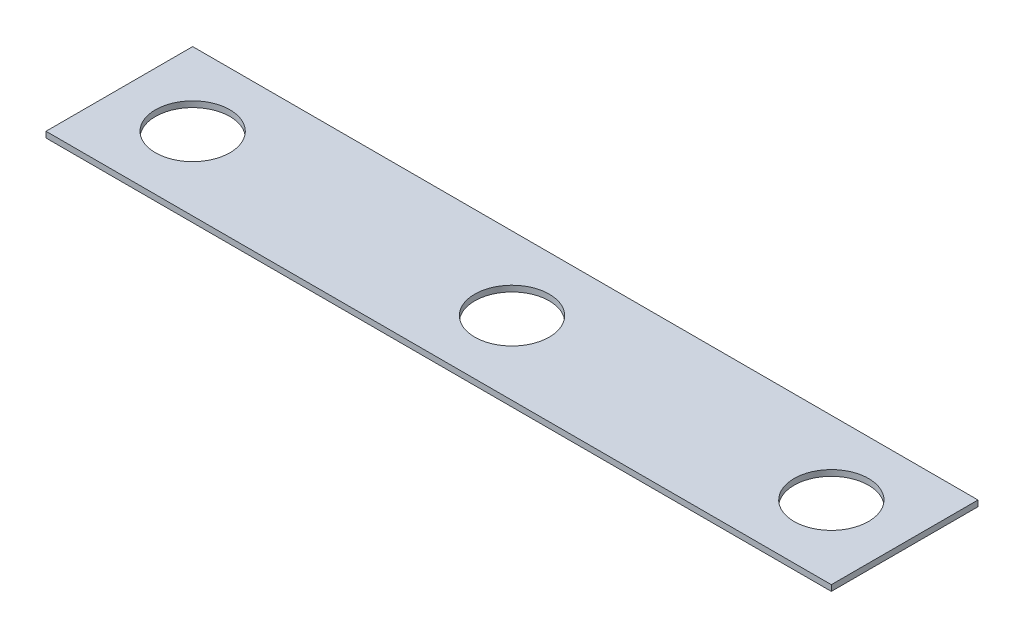
ISO-10303-21;
HEADER;
FILE_DESCRIPTION(('STEP AP214'),'2;1');
FILE_NAME('part.step','',(''),(''),'','','');
FILE_SCHEMA(('AUTOMOTIVE_DESIGN { 1 0 10303 214 1 1 1 1 }'));
ENDSEC;
DATA;
#1=APPLICATION_CONTEXT('core data for automotive mechanical design processes');
#2=APPLICATION_PROTOCOL_DEFINITION('international standard','automotive_design',2000,#1);
#3=PRODUCT_CONTEXT('',#1,'mechanical');
#4=PRODUCT('Part','Part','',(#3));
#5=PRODUCT_RELATED_PRODUCT_CATEGORY('part','',(#4));
#6=PRODUCT_DEFINITION_FORMATION('','',#4);
#7=PRODUCT_DEFINITION_CONTEXT('part definition',#1,'design');
#8=PRODUCT_DEFINITION('design','',#6,#7);
#9=PRODUCT_DEFINITION_SHAPE('','',#8);
#10=(LENGTH_UNIT() NAMED_UNIT(*) SI_UNIT(.MILLI.,.METRE.));
#11=(NAMED_UNIT(*) PLANE_ANGLE_UNIT() SI_UNIT($,.RADIAN.));
#12=(NAMED_UNIT(*) SI_UNIT($,.STERADIAN.) SOLID_ANGLE_UNIT());
#13=UNCERTAINTY_MEASURE_WITH_UNIT(LENGTH_MEASURE(1.E-05),#10,'distance_accuracy_value','');
#14=(GEOMETRIC_REPRESENTATION_CONTEXT(3) GLOBAL_UNCERTAINTY_ASSIGNED_CONTEXT((#13)) GLOBAL_UNIT_ASSIGNED_CONTEXT((#10,
#11,#12)) REPRESENTATION_CONTEXT('',''));
#15=CARTESIAN_POINT('',(0.,0.,0.));
#16=DIRECTION('',(0.,0.,1.));
#17=DIRECTION('',(1.,0.,0.));
#18=AXIS2_PLACEMENT_3D('',#15,#16,#17);
#19=CARTESIAN_POINT('',(8.5,0.127,1.5875));
#20=DIRECTION('',(-1.,0.,0.));
#21=DIRECTION('',(0.,0.,1.));
#22=AXIS2_PLACEMENT_3D('',#19,#20,#21);
#23=PLANE('',#22);
#24=DIRECTION('',(0.,0.,-1.));
#25=VECTOR('',#24,1.);
#26=CARTESIAN_POINT('',(8.5,0.,1.5875));
#27=LINE('',#26,#25);
#28=CARTESIAN_POINT('',(8.5,0.,1.5875));
#29=VERTEX_POINT('',#28);
#30=CARTESIAN_POINT('',(8.5,0.,-1.5875));
#31=VERTEX_POINT('',#30);
#32=EDGE_CURVE('E97',#29,#31,#27,.T.);
#33=ORIENTED_EDGE('',*,*,#32,.T.);
#34=DIRECTION('',(0.,-1.,0.));
#35=VECTOR('',#34,1.);
#36=CARTESIAN_POINT('',(8.5,0.127,-1.5875));
#37=LINE('',#36,#35);
#38=CARTESIAN_POINT('',(8.5,0.127,-1.5875));
#39=VERTEX_POINT('',#38);
#40=EDGE_CURVE('E11',#39,#31,#37,.T.);
#41=ORIENTED_EDGE('',*,*,#40,.F.);
#42=DIRECTION('',(0.,0.,-1.));
#43=VECTOR('',#42,1.);
#44=CARTESIAN_POINT('',(8.5,0.127,1.5875));
#45=LINE('',#44,#43);
#46=CARTESIAN_POINT('',(8.5,0.127,1.5875));
#47=VERTEX_POINT('',#46);
#48=EDGE_CURVE('E84',#47,#39,#45,.T.);
#49=ORIENTED_EDGE('',*,*,#48,.F.);
#50=DIRECTION('',(0.,-1.,0.));
#51=VECTOR('',#50,1.);
#52=CARTESIAN_POINT('',(8.5,0.127,1.5875));
#53=LINE('',#52,#51);
#54=EDGE_CURVE('E93',#47,#29,#53,.T.);
#55=ORIENTED_EDGE('',*,*,#54,.T.);
#56=EDGE_LOOP('',(#33,#41,#49,#55));
#57=FACE_BOUND('',#56,.T.);
#58=ADVANCED_FACE('F32',(#57),#23,.F.);
#59=CARTESIAN_POINT('',(-8.5,0.127,-1.5875));
#60=DIRECTION('',(0.,0.,1.));
#61=DIRECTION('',(1.,0.,0.));
#62=AXIS2_PLACEMENT_3D('',#59,#60,#61);
#63=PLANE('',#62);
#64=DIRECTION('',(-1.,0.,0.));
#65=VECTOR('',#64,1.);
#66=CARTESIAN_POINT('',(-8.5,0.,-1.5875));
#67=LINE('',#66,#65);
#68=CARTESIAN_POINT('',(-8.5,0.,-1.5875));
#69=VERTEX_POINT('',#68);
#70=EDGE_CURVE('E88',#31,#69,#67,.T.);
#71=ORIENTED_EDGE('',*,*,#70,.T.);
#72=DIRECTION('',(0.,-1.,0.));
#73=VECTOR('',#72,1.);
#74=CARTESIAN_POINT('',(-8.5,0.127,-1.5875));
#75=LINE('',#74,#73);
#76=CARTESIAN_POINT('',(-8.5,0.127,-1.5875));
#77=VERTEX_POINT('',#76);
#78=EDGE_CURVE('E41',#77,#69,#75,.T.);
#79=ORIENTED_EDGE('',*,*,#78,.F.);
#80=DIRECTION('',(-1.,0.,0.));
#81=VECTOR('',#80,1.);
#82=CARTESIAN_POINT('',(-8.5,0.127,-1.5875));
#83=LINE('',#82,#81);
#84=EDGE_CURVE('E79',#39,#77,#83,.T.);
#85=ORIENTED_EDGE('',*,*,#84,.F.);
#86=ORIENTED_EDGE('',*,*,#40,.T.);
#87=EDGE_LOOP('',(#71,#79,#85,#86));
#88=FACE_BOUND('',#87,.T.);
#89=ADVANCED_FACE('F87',(#88),#63,.F.);
#90=CARTESIAN_POINT('',(-8.5,0.127,1.5875));
#91=DIRECTION('',(1.,0.,0.));
#92=DIRECTION('',(0.,0.,-1.));
#93=AXIS2_PLACEMENT_3D('',#90,#91,#92);
#94=PLANE('',#93);
#95=DIRECTION('',(0.,0.,1.));
#96=VECTOR('',#95,1.);
#97=CARTESIAN_POINT('',(-8.5,0.,1.5875));
#98=LINE('',#97,#96);
#99=CARTESIAN_POINT('',(-8.5,0.,1.5875));
#100=VERTEX_POINT('',#99);
#101=EDGE_CURVE('E66',#69,#100,#98,.T.);
#102=ORIENTED_EDGE('',*,*,#101,.T.);
#103=DIRECTION('',(0.,-1.,0.));
#104=VECTOR('',#103,1.);
#105=CARTESIAN_POINT('',(-8.5,0.127,1.5875));
#106=LINE('',#105,#104);
#107=CARTESIAN_POINT('',(-8.5,0.127,1.5875));
#108=VERTEX_POINT('',#107);
#109=EDGE_CURVE('E89',#108,#100,#106,.T.);
#110=ORIENTED_EDGE('',*,*,#109,.F.);
#111=DIRECTION('',(0.,0.,1.));
#112=VECTOR('',#111,1.);
#113=CARTESIAN_POINT('',(-8.5,0.127,1.5875));
#114=LINE('',#113,#112);
#115=EDGE_CURVE('E82',#77,#108,#114,.T.);
#116=ORIENTED_EDGE('',*,*,#115,.F.);
#117=ORIENTED_EDGE('',*,*,#78,.T.);
#118=EDGE_LOOP('',(#102,#110,#116,#117));
#119=FACE_BOUND('',#118,.T.);
#120=ADVANCED_FACE('F91',(#119),#94,.F.);
#121=CARTESIAN_POINT('',(-8.5,0.127,1.5875));
#122=DIRECTION('',(0.,0.,-1.));
#123=DIRECTION('',(-1.,0.,0.));
#124=AXIS2_PLACEMENT_3D('',#121,#122,#123);
#125=PLANE('',#124);
#126=DIRECTION('',(1.,0.,0.));
#127=VECTOR('',#126,1.);
#128=CARTESIAN_POINT('',(-8.5,0.,1.5875));
#129=LINE('',#128,#127);
#130=EDGE_CURVE('E72',#100,#29,#129,.T.);
#131=ORIENTED_EDGE('',*,*,#130,.T.);
#132=ORIENTED_EDGE('',*,*,#54,.F.);
#133=DIRECTION('',(1.,0.,0.));
#134=VECTOR('',#133,1.);
#135=CARTESIAN_POINT('',(-8.5,0.127,1.5875));
#136=LINE('',#135,#134);
#137=EDGE_CURVE('E49',#108,#47,#136,.T.);
#138=ORIENTED_EDGE('',*,*,#137,.F.);
#139=ORIENTED_EDGE('',*,*,#109,.T.);
#140=EDGE_LOOP('',(#131,#132,#138,#139));
#141=FACE_BOUND('',#140,.T.);
#142=ADVANCED_FACE('F105',(#141),#125,.F.);
#143=CARTESIAN_POINT('',(8.5,0.127,-1.5875));
#144=DIRECTION('',(0.,-1.,0.));
#145=DIRECTION('',(0.,0.,-1.));
#146=AXIS2_PLACEMENT_3D('',#143,#144,#145);
#147=PLANE('',#146);
#148=CARTESIAN_POINT('',(0.,0.127,0.));
#149=DIRECTION('',(0.,1.,0.));
#150=DIRECTION('',(0.,0.,1.));
#151=AXIS2_PLACEMENT_3D('',#148,#149,#150);
#152=CIRCLE('',#151,0.806449999999999);
#153=CARTESIAN_POINT('',(0.,0.127,0.806449999999999));
#154=VERTEX_POINT('',#153);
#155=EDGE_CURVE('E122',#154,#154,#152,.T.);
#156=ORIENTED_EDGE('',*,*,#155,.F.);
#157=EDGE_LOOP('',(#156));
#158=FACE_BOUND('',#157,.T.);
#159=CARTESIAN_POINT('',(6.9125,0.127,0.));
#160=DIRECTION('',(0.,1.,0.));
#161=DIRECTION('',(0.,0.,1.));
#162=AXIS2_PLACEMENT_3D('',#159,#160,#161);
#163=CIRCLE('',#162,0.806449999999999);
#164=CARTESIAN_POINT('',(6.9125,0.127,0.806449999999999));
#165=VERTEX_POINT('',#164);
#166=EDGE_CURVE('E116',#165,#165,#163,.T.);
#167=ORIENTED_EDGE('',*,*,#166,.F.);
#168=EDGE_LOOP('',(#167));
#169=FACE_BOUND('',#168,.T.);
#170=CARTESIAN_POINT('',(-6.9125,0.127,0.));
#171=DIRECTION('',(0.,1.,0.));
#172=DIRECTION('',(0.,0.,1.));
#173=AXIS2_PLACEMENT_3D('',#170,#171,#172);
#174=CIRCLE('',#173,0.806449999999999);
#175=CARTESIAN_POINT('',(-6.9125,0.127,0.806449999999999));
#176=VERTEX_POINT('',#175);
#177=EDGE_CURVE('E113',#176,#176,#174,.T.);
#178=ORIENTED_EDGE('',*,*,#177,.F.);
#179=EDGE_LOOP('',(#178));
#180=FACE_BOUND('',#179,.T.);
#181=ORIENTED_EDGE('',*,*,#48,.T.);
#182=ORIENTED_EDGE('',*,*,#84,.T.);
#183=ORIENTED_EDGE('',*,*,#115,.T.);
#184=ORIENTED_EDGE('',*,*,#137,.T.);
#185=EDGE_LOOP('',(#181,#182,#183,#184));
#186=FACE_BOUND('',#185,.T.);
#187=ADVANCED_FACE('F80',(#158,#169,#180,#186),#147,.F.);
#188=CARTESIAN_POINT('',(8.5,0.,-1.5875));
#189=DIRECTION('',(0.,-1.,0.));
#190=DIRECTION('',(0.,0.,-1.));
#191=AXIS2_PLACEMENT_3D('',#188,#189,#190);
#192=PLANE('',#191);
#193=CARTESIAN_POINT('',(0.,0.,0.));
#194=DIRECTION('',(0.,-1.,0.));
#195=DIRECTION('',(0.,0.,-1.));
#196=AXIS2_PLACEMENT_3D('',#193,#194,#195);
#197=CIRCLE('',#196,0.806449999999999);
#198=CARTESIAN_POINT('',(0.,0.,-0.806449999999999));
#199=VERTEX_POINT('',#198);
#200=EDGE_CURVE('E119',#199,#199,#197,.T.);
#201=ORIENTED_EDGE('',*,*,#200,.F.);
#202=EDGE_LOOP('',(#201));
#203=FACE_BOUND('',#202,.T.);
#204=CARTESIAN_POINT('',(6.9125,0.,0.));
#205=DIRECTION('',(0.,-1.,0.));
#206=DIRECTION('',(0.,0.,-1.));
#207=AXIS2_PLACEMENT_3D('',#204,#205,#206);
#208=CIRCLE('',#207,0.806449999999999);
#209=CARTESIAN_POINT('',(6.9125,0.,-0.806449999999999));
#210=VERTEX_POINT('',#209);
#211=EDGE_CURVE('E35',#210,#210,#208,.T.);
#212=ORIENTED_EDGE('',*,*,#211,.F.);
#213=EDGE_LOOP('',(#212));
#214=FACE_BOUND('',#213,.T.);
#215=CARTESIAN_POINT('',(-6.9125,0.,0.));
#216=DIRECTION('',(0.,-1.,0.));
#217=DIRECTION('',(0.,0.,-1.));
#218=AXIS2_PLACEMENT_3D('',#215,#216,#217);
#219=CIRCLE('',#218,0.806449999999999);
#220=CARTESIAN_POINT('',(-6.9125,0.,-0.806449999999999));
#221=VERTEX_POINT('',#220);
#222=EDGE_CURVE('E100',#221,#221,#219,.T.);
#223=ORIENTED_EDGE('',*,*,#222,.F.);
#224=EDGE_LOOP('',(#223));
#225=FACE_BOUND('',#224,.T.);
#226=ORIENTED_EDGE('',*,*,#32,.F.);
#227=ORIENTED_EDGE('',*,*,#130,.F.);
#228=ORIENTED_EDGE('',*,*,#101,.F.);
#229=ORIENTED_EDGE('',*,*,#70,.F.);
#230=EDGE_LOOP('',(#226,#227,#228,#229));
#231=FACE_BOUND('',#230,.T.);
#232=ADVANCED_FACE('F108',(#203,#214,#225,#231),#192,.T.);
#233=CARTESIAN_POINT('',(-6.9125,0.127,0.));
#234=DIRECTION('',(0.,1.,0.));
#235=DIRECTION('',(0.,0.,1.));
#236=AXIS2_PLACEMENT_3D('',#233,#234,#235);
#237=CYLINDRICAL_SURFACE('',#236,0.806449999999999);
#238=ORIENTED_EDGE('',*,*,#222,.T.);
#239=EDGE_LOOP('',(#238));
#240=FACE_BOUND('',#239,.T.);
#241=ORIENTED_EDGE('',*,*,#177,.T.);
#242=EDGE_LOOP('',(#241));
#243=FACE_BOUND('',#242,.T.);
#244=ADVANCED_FACE('F135',(#240,#243),#237,.F.);
#245=CARTESIAN_POINT('',(6.9125,0.127,0.));
#246=DIRECTION('',(0.,1.,0.));
#247=DIRECTION('',(0.,0.,1.));
#248=AXIS2_PLACEMENT_3D('',#245,#246,#247);
#249=CYLINDRICAL_SURFACE('',#248,0.806449999999999);
#250=ORIENTED_EDGE('',*,*,#211,.T.);
#251=EDGE_LOOP('',(#250));
#252=FACE_BOUND('',#251,.T.);
#253=ORIENTED_EDGE('',*,*,#166,.T.);
#254=EDGE_LOOP('',(#253));
#255=FACE_BOUND('',#254,.T.);
#256=ADVANCED_FACE('F137',(#252,#255),#249,.F.);
#257=CARTESIAN_POINT('',(0.,0.127,0.));
#258=DIRECTION('',(0.,1.,0.));
#259=DIRECTION('',(0.,0.,1.));
#260=AXIS2_PLACEMENT_3D('',#257,#258,#259);
#261=CYLINDRICAL_SURFACE('',#260,0.806449999999999);
#262=ORIENTED_EDGE('',*,*,#200,.T.);
#263=EDGE_LOOP('',(#262));
#264=FACE_BOUND('',#263,.T.);
#265=ORIENTED_EDGE('',*,*,#155,.T.);
#266=EDGE_LOOP('',(#265));
#267=FACE_BOUND('',#266,.T.);
#268=ADVANCED_FACE('F126',(#264,#267),#261,.F.);
#269=CLOSED_SHELL('',(#58,#89,#120,#142,#187,#232,#244,#256,#268));
#270=MANIFOLD_SOLID_BREP('B2',#269);
#271=ADVANCED_BREP_SHAPE_REPRESENTATION('',(#18,#270),#14);
#272=SHAPE_DEFINITION_REPRESENTATION(#9,#271);
ENDSEC;
END-ISO-10303-21;
